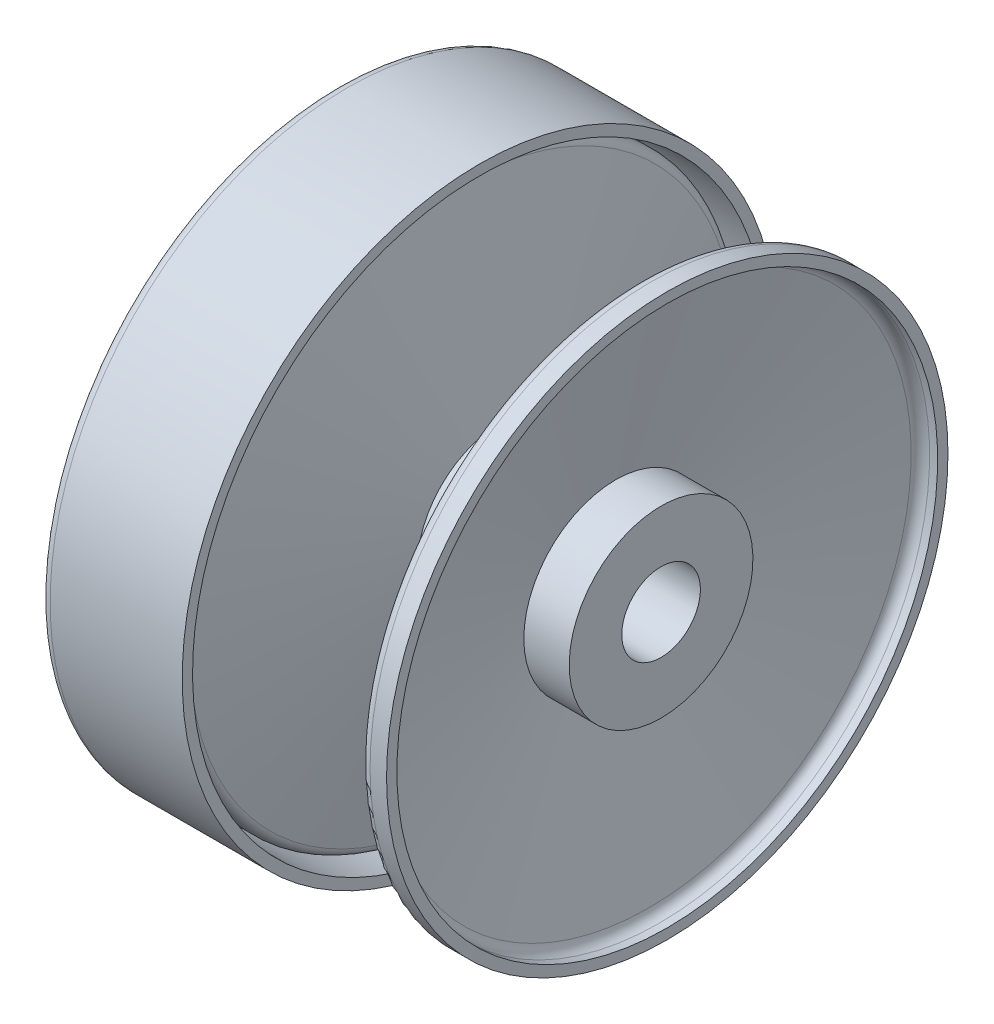
ISO-10303-21;
HEADER;
FILE_DESCRIPTION(('STEP AP214'),'2;1');
FILE_NAME('part.step','',(''),(''),'','','');
FILE_SCHEMA(('AUTOMOTIVE_DESIGN { 1 0 10303 214 1 1 1 1 }'));
ENDSEC;
DATA;
#1=APPLICATION_CONTEXT('core data for automotive mechanical design processes');
#2=APPLICATION_PROTOCOL_DEFINITION('international standard','automotive_design',2000,#1);
#3=PRODUCT_CONTEXT('',#1,'mechanical');
#4=PRODUCT('Part','Part','',(#3));
#5=PRODUCT_RELATED_PRODUCT_CATEGORY('part','',(#4));
#6=PRODUCT_DEFINITION_FORMATION('','',#4);
#7=PRODUCT_DEFINITION_CONTEXT('part definition',#1,'design');
#8=PRODUCT_DEFINITION('design','',#6,#7);
#9=PRODUCT_DEFINITION_SHAPE('','',#8);
#10=(LENGTH_UNIT() NAMED_UNIT(*) SI_UNIT(.MILLI.,.METRE.));
#11=(NAMED_UNIT(*) PLANE_ANGLE_UNIT() SI_UNIT($,.RADIAN.));
#12=(NAMED_UNIT(*) SI_UNIT($,.STERADIAN.) SOLID_ANGLE_UNIT());
#13=UNCERTAINTY_MEASURE_WITH_UNIT(LENGTH_MEASURE(1.E-05),#10,'distance_accuracy_value','');
#14=(GEOMETRIC_REPRESENTATION_CONTEXT(3) GLOBAL_UNCERTAINTY_ASSIGNED_CONTEXT((#13)) GLOBAL_UNIT_ASSIGNED_CONTEXT((#10,
#11,#12)) REPRESENTATION_CONTEXT('',''));
#15=CARTESIAN_POINT('',(0.,0.,0.));
#16=DIRECTION('',(0.,0.,1.));
#17=DIRECTION('',(1.,0.,0.));
#18=AXIS2_PLACEMENT_3D('',#15,#16,#17);
#19=CARTESIAN_POINT('',(-50.,12.75,0.));
#20=DIRECTION('',(1.,0.,0.));
#21=DIRECTION('',(0.,1.,0.));
#22=AXIS2_PLACEMENT_3D('',#19,#20,#21);
#23=PLANE('',#22);
#24=CARTESIAN_POINT('',(-50.,0.,0.));
#25=DIRECTION('',(-1.,0.,0.));
#26=DIRECTION('',(0.,-1.,0.));
#27=AXIS2_PLACEMENT_3D('',#24,#25,#26);
#28=CIRCLE('',#27,12.75);
#29=CARTESIAN_POINT('',(-50.,-12.75,0.));
#30=VERTEX_POINT('',#29);
#31=EDGE_CURVE('E168',#30,#30,#28,.T.);
#32=ORIENTED_EDGE('',*,*,#31,.F.);
#33=EDGE_LOOP('',(#32));
#34=FACE_BOUND('',#33,.T.);
#35=DIRECTION('',(0.,0.499999999999995,-0.866025403784442));
#36=VECTOR('',#35,1.);
#37=CARTESIAN_POINT('',(-50.,12.8750000000003,22.3001541474492));
#38=LINE('',#37,#36);
#39=CARTESIAN_POINT('',(-50.,12.8750000000003,22.3001541474492));
#40=VERTEX_POINT('',#39);
#41=CARTESIAN_POINT('',(-50.,25.75,0.));
#42=VERTEX_POINT('',#41);
#43=EDGE_CURVE('E100',#40,#42,#38,.T.);
#44=ORIENTED_EDGE('',*,*,#43,.T.);
#45=DIRECTION('',(0.,-0.500000000000001,-0.866025403784438));
#46=VECTOR('',#45,1.);
#47=CARTESIAN_POINT('',(-50.,25.75,0.));
#48=LINE('',#47,#46);
#49=CARTESIAN_POINT('',(-50.,12.875,-22.3001541474493));
#50=VERTEX_POINT('',#49);
#51=EDGE_CURVE('E108',#42,#50,#48,.T.);
#52=ORIENTED_EDGE('',*,*,#51,.T.);
#53=DIRECTION('',(0.,-1.,0.));
#54=VECTOR('',#53,1.);
#55=CARTESIAN_POINT('',(-50.,12.8749999999999,-22.3001541474493));
#56=LINE('',#55,#54);
#57=CARTESIAN_POINT('',(-50.,-12.8750000000001,-22.3001541474492));
#58=VERTEX_POINT('',#57);
#59=EDGE_CURVE('E59',#50,#58,#56,.T.);
#60=ORIENTED_EDGE('',*,*,#59,.T.);
#61=DIRECTION('',(0.,-0.499999999999995,0.866025403784441));
#62=VECTOR('',#61,1.);
#63=CARTESIAN_POINT('',(-50.,-12.8750000000001,-22.3001541474492));
#64=LINE('',#63,#62);
#65=CARTESIAN_POINT('',(-50.,-25.75,1.79811288950421E-13));
#66=VERTEX_POINT('',#65);
#67=EDGE_CURVE('E132',#58,#66,#64,.T.);
#68=ORIENTED_EDGE('',*,*,#67,.T.);
#69=DIRECTION('',(0.,0.500000000000007,0.866025403784434));
#70=VECTOR('',#69,1.);
#71=CARTESIAN_POINT('',(-50.,-25.75,1.79811288950421E-13));
#72=LINE('',#71,#70);
#73=CARTESIAN_POINT('',(-50.,-12.8749999999998,22.3001541474494));
#74=VERTEX_POINT('',#73);
#75=EDGE_CURVE('E129',#66,#74,#72,.T.);
#76=ORIENTED_EDGE('',*,*,#75,.T.);
#77=DIRECTION('',(0.,1.,0.));
#78=VECTOR('',#77,1.);
#79=CARTESIAN_POINT('',(-50.,-12.8749999999998,22.3001541474494));
#80=LINE('',#79,#78);
#81=EDGE_CURVE('E126',#74,#40,#80,.T.);
#82=ORIENTED_EDGE('',*,*,#81,.T.);
#83=EDGE_LOOP('',(#44,#52,#60,#68,#76,#82));
#84=FACE_BOUND('',#83,.T.);
#85=ADVANCED_FACE('F36',(#34,#84),#23,.F.);
#86=CARTESIAN_POINT('',(-50.,0.,0.));
#87=DIRECTION('',(-1.,0.,0.));
#88=DIRECTION('',(0.,-1.,0.));
#89=AXIS2_PLACEMENT_3D('',#86,#87,#88);
#90=CYLINDRICAL_SURFACE('',#89,68.);
#91=CARTESIAN_POINT('',(-2.05649403407394,0.,0.));
#92=DIRECTION('',(1.,0.,0.));
#93=DIRECTION('',(0.,1.,0.));
#94=AXIS2_PLACEMENT_3D('',#91,#92,#93);
#95=CIRCLE('',#94,68.);
#96=CARTESIAN_POINT('',(-2.05649403407395,68.,0.));
#97=VERTEX_POINT('',#96);
#98=EDGE_CURVE('E213',#97,#97,#95,.F.);
#99=ORIENTED_EDGE('',*,*,#98,.T.);
#100=EDGE_LOOP('',(#99));
#101=FACE_BOUND('',#100,.T.);
#102=CARTESIAN_POINT('',(-6.05649403407392,0.,0.));
#103=DIRECTION('',(-1.,0.,0.));
#104=DIRECTION('',(0.,-1.,0.));
#105=AXIS2_PLACEMENT_3D('',#102,#103,#104);
#106=CIRCLE('',#105,68.);
#107=CARTESIAN_POINT('',(-6.05649403407391,-68.,0.));
#108=VERTEX_POINT('',#107);
#109=EDGE_CURVE('E192',#108,#108,#106,.T.);
#110=ORIENTED_EDGE('',*,*,#109,.F.);
#111=EDGE_LOOP('',(#110));
#112=FACE_BOUND('',#111,.T.);
#113=ADVANCED_FACE('F242',(#101,#112),#90,.T.);
#114=CARTESIAN_POINT('',(-6.05649403407393,68.,0.));
#115=DIRECTION('',(1.,0.,0.));
#116=DIRECTION('',(0.,1.,0.));
#117=AXIS2_PLACEMENT_3D('',#114,#115,#116);
#118=PLANE('',#117);
#119=CARTESIAN_POINT('',(-6.05649403407392,0.,0.));
#120=DIRECTION('',(-1.,0.,0.));
#121=DIRECTION('',(0.,-1.,0.));
#122=AXIS2_PLACEMENT_3D('',#119,#120,#121);
#123=CIRCLE('',#122,65.5);
#124=CARTESIAN_POINT('',(-6.05649403407391,-65.5,0.));
#125=VERTEX_POINT('',#124);
#126=EDGE_CURVE('E189',#125,#125,#123,.T.);
#127=ORIENTED_EDGE('',*,*,#126,.F.);
#128=EDGE_LOOP('',(#127));
#129=FACE_BOUND('',#128,.T.);
#130=ORIENTED_EDGE('',*,*,#109,.T.);
#131=EDGE_LOOP('',(#130));
#132=FACE_BOUND('',#131,.T.);
#133=ADVANCED_FACE('F248',(#129,#132),#118,.F.);
#134=CARTESIAN_POINT('',(-50.,0.,0.));
#135=DIRECTION('',(-1.,0.,0.));
#136=DIRECTION('',(0.,-1.,0.));
#137=AXIS2_PLACEMENT_3D('',#134,#135,#136);
#138=CYLINDRICAL_SURFACE('',#137,65.5);
#139=CARTESIAN_POINT('',(-2.05649403407392,0.,0.));
#140=DIRECTION('',(-1.,0.,0.));
#141=DIRECTION('',(0.,-1.,0.));
#142=AXIS2_PLACEMENT_3D('',#139,#140,#141);
#143=CIRCLE('',#142,65.5);
#144=CARTESIAN_POINT('',(-2.05649403407391,-65.5,0.));
#145=VERTEX_POINT('',#144);
#146=EDGE_CURVE('E186',#145,#145,#143,.T.);
#147=ORIENTED_EDGE('',*,*,#146,.F.);
#148=EDGE_LOOP('',(#147));
#149=FACE_BOUND('',#148,.T.);
#150=ORIENTED_EDGE('',*,*,#126,.T.);
#151=EDGE_LOOP('',(#150));
#152=FACE_BOUND('',#151,.T.);
#153=ADVANCED_FACE('F291',(#149,#152),#138,.F.);
#154=CARTESIAN_POINT('',(-2.05649403407392,0.,0.));
#155=DIRECTION('',(-1.,0.,0.));
#156=DIRECTION('',(0.,-1.,0.));
#157=AXIS2_PLACEMENT_3D('',#154,#155,#156);
#158=CONICAL_SURFACE('',#157,65.5,1.37673779571502);
#159=CARTESIAN_POINT('',(6.44350596592599,0.,0.));
#160=DIRECTION('',(-1.,0.,0.));
#161=DIRECTION('',(0.,-1.,0.));
#162=AXIS2_PLACEMENT_3D('',#159,#160,#161);
#163=CIRCLE('',#162,22.25);
#164=CARTESIAN_POINT('',(6.44350596592599,-22.25,0.));
#165=VERTEX_POINT('',#164);
#166=EDGE_CURVE('E183',#165,#165,#163,.T.);
#167=ORIENTED_EDGE('',*,*,#166,.F.);
#168=EDGE_LOOP('',(#167));
#169=FACE_BOUND('',#168,.T.);
#170=ORIENTED_EDGE('',*,*,#146,.T.);
#171=EDGE_LOOP('',(#170));
#172=FACE_BOUND('',#171,.T.);
#173=ADVANCED_FACE('F287',(#169,#172),#158,.F.);
#174=CARTESIAN_POINT('',(-50.,0.,0.));
#175=DIRECTION('',(-1.,0.,0.));
#176=DIRECTION('',(0.,-1.,0.));
#177=AXIS2_PLACEMENT_3D('',#174,#175,#176);
#178=CYLINDRICAL_SURFACE('',#177,22.25);
#179=CARTESIAN_POINT('',(-15.,0.,0.));
#180=DIRECTION('',(-1.,0.,0.));
#181=DIRECTION('',(0.,-1.,0.));
#182=AXIS2_PLACEMENT_3D('',#179,#180,#181);
#183=CIRCLE('',#182,22.25);
#184=CARTESIAN_POINT('',(-15.,-22.25,0.));
#185=VERTEX_POINT('',#184);
#186=EDGE_CURVE('E180',#185,#185,#183,.T.);
#187=ORIENTED_EDGE('',*,*,#186,.F.);
#188=EDGE_LOOP('',(#187));
#189=FACE_BOUND('',#188,.T.);
#190=ORIENTED_EDGE('',*,*,#166,.T.);
#191=EDGE_LOOP('',(#190));
#192=FACE_BOUND('',#191,.T.);
#193=ADVANCED_FACE('F283',(#189,#192),#178,.T.);
#194=CARTESIAN_POINT('',(-15.,22.25,0.));
#195=DIRECTION('',(-1.,0.,0.));
#196=DIRECTION('',(0.,-1.,0.));
#197=AXIS2_PLACEMENT_3D('',#194,#195,#196);
#198=PLANE('',#197);
#199=CARTESIAN_POINT('',(-15.,0.,0.));
#200=DIRECTION('',(-1.,0.,0.));
#201=DIRECTION('',(0.,-1.,0.));
#202=AXIS2_PLACEMENT_3D('',#199,#200,#201);
#203=CIRCLE('',#202,69.5);
#204=CARTESIAN_POINT('',(-15.,-69.5,0.));
#205=VERTEX_POINT('',#204);
#206=EDGE_CURVE('E177',#205,#205,#203,.T.);
#207=ORIENTED_EDGE('',*,*,#206,.F.);
#208=EDGE_LOOP('',(#207));
#209=FACE_BOUND('',#208,.T.);
#210=ORIENTED_EDGE('',*,*,#186,.T.);
#211=EDGE_LOOP('',(#210));
#212=FACE_BOUND('',#211,.T.);
#213=ADVANCED_FACE('F279',(#209,#212),#198,.F.);
#214=CARTESIAN_POINT('',(-50.,0.,0.));
#215=DIRECTION('',(-1.,0.,0.));
#216=DIRECTION('',(0.,-1.,0.));
#217=AXIS2_PLACEMENT_3D('',#214,#215,#216);
#218=CYLINDRICAL_SURFACE('',#217,69.5);
#219=CARTESIAN_POINT('',(4.5,0.,0.));
#220=DIRECTION('',(-1.,0.,0.));
#221=DIRECTION('',(0.,-1.,0.));
#222=AXIS2_PLACEMENT_3D('',#219,#220,#221);
#223=CIRCLE('',#222,69.5);
#224=CARTESIAN_POINT('',(4.50000000000001,-69.5,0.));
#225=VERTEX_POINT('',#224);
#226=EDGE_CURVE('E174',#225,#225,#223,.T.);
#227=ORIENTED_EDGE('',*,*,#226,.F.);
#228=EDGE_LOOP('',(#227));
#229=FACE_BOUND('',#228,.T.);
#230=ORIENTED_EDGE('',*,*,#206,.T.);
#231=EDGE_LOOP('',(#230));
#232=FACE_BOUND('',#231,.T.);
#233=ADVANCED_FACE('F275',(#229,#232),#218,.F.);
#234=CARTESIAN_POINT('',(4.49999999999998,72.,0.));
#235=DIRECTION('',(-1.,0.,0.));
#236=DIRECTION('',(0.,-1.,0.));
#237=AXIS2_PLACEMENT_3D('',#234,#235,#236);
#238=PLANE('',#237);
#239=CARTESIAN_POINT('',(4.5,0.,0.));
#240=DIRECTION('',(-1.,0.,0.));
#241=DIRECTION('',(0.,-1.,0.));
#242=AXIS2_PLACEMENT_3D('',#239,#240,#241);
#243=CIRCLE('',#242,72.);
#244=CARTESIAN_POINT('',(4.50000000000001,-72.,0.));
#245=VERTEX_POINT('',#244);
#246=EDGE_CURVE('E171',#245,#245,#243,.T.);
#247=ORIENTED_EDGE('',*,*,#246,.F.);
#248=EDGE_LOOP('',(#247));
#249=FACE_BOUND('',#248,.T.);
#250=ORIENTED_EDGE('',*,*,#226,.T.);
#251=EDGE_LOOP('',(#250));
#252=FACE_BOUND('',#251,.T.);
#253=ADVANCED_FACE('F271',(#249,#252),#238,.F.);
#254=CARTESIAN_POINT('',(-50.,0.,0.));
#255=DIRECTION('',(-1.,0.,0.));
#256=DIRECTION('',(0.,-1.,0.));
#257=AXIS2_PLACEMENT_3D('',#254,#255,#256);
#258=CYLINDRICAL_SURFACE('',#257,72.);
#259=CARTESIAN_POINT('',(-27.5,0.,0.));
#260=DIRECTION('',(1.,0.,0.));
#261=DIRECTION('',(0.,1.,0.));
#262=AXIS2_PLACEMENT_3D('',#259,#260,#261);
#263=CIRCLE('',#262,72.);
#264=CARTESIAN_POINT('',(-27.5,72.,0.));
#265=VERTEX_POINT('',#264);
#266=EDGE_CURVE('E210',#265,#265,#263,.T.);
#267=ORIENTED_EDGE('',*,*,#266,.T.);
#268=EDGE_LOOP('',(#267));
#269=FACE_BOUND('',#268,.T.);
#270=ORIENTED_EDGE('',*,*,#246,.T.);
#271=EDGE_LOOP('',(#270));
#272=FACE_BOUND('',#271,.T.);
#273=ADVANCED_FACE('F267',(#269,#272),#258,.T.);
#274=CARTESIAN_POINT('',(-30.,52.,0.));
#275=DIRECTION('',(1.,0.,0.));
#276=DIRECTION('',(0.,1.,0.));
#277=AXIS2_PLACEMENT_3D('',#274,#275,#276);
#278=PLANE('',#277);
#279=CARTESIAN_POINT('',(-30.,0.,0.));
#280=DIRECTION('',(1.,0.,0.));
#281=DIRECTION('',(0.,1.,0.));
#282=AXIS2_PLACEMENT_3D('',#279,#280,#281);
#283=CIRCLE('',#282,53.5450849718747);
#284=CARTESIAN_POINT('',(-30.,53.5450849718747,0.));
#285=VERTEX_POINT('',#284);
#286=EDGE_CURVE('E207',#285,#285,#283,.T.);
#287=ORIENTED_EDGE('',*,*,#286,.T.);
#288=EDGE_LOOP('',(#287));
#289=FACE_BOUND('',#288,.T.);
#290=CARTESIAN_POINT('',(-30.,0.,0.));
#291=DIRECTION('',(1.,0.,0.));
#292=DIRECTION('',(0.,1.,0.));
#293=AXIS2_PLACEMENT_3D('',#290,#291,#292);
#294=CIRCLE('',#293,69.5);
#295=CARTESIAN_POINT('',(-30.,69.5,0.));
#296=VERTEX_POINT('',#295);
#297=EDGE_CURVE('E204',#296,#296,#294,.F.);
#298=ORIENTED_EDGE('',*,*,#297,.T.);
#299=EDGE_LOOP('',(#298));
#300=FACE_BOUND('',#299,.T.);
#301=ADVANCED_FACE('F263',(#289,#300),#278,.F.);
#302=CARTESIAN_POINT('',(-30.,0.,0.));
#303=DIRECTION('',(1.,0.,0.));
#304=DIRECTION('',(0.,1.,0.));
#305=AXIS2_PLACEMENT_3D('',#302,#303,#304);
#306=CONICAL_SURFACE('',#305,52.,0.463647609000805);
#307=CARTESIAN_POINT('',(-39.6180339887499,0.,0.));
#308=DIRECTION('',(-1.,0.,0.));
#309=DIRECTION('',(0.,-1.,0.));
#310=AXIS2_PLACEMENT_3D('',#307,#308,#309);
#311=CIRCLE('',#310,47.1909830056251);
#312=CARTESIAN_POINT('',(-39.6180339887499,-47.1909830056251,0.));
#313=VERTEX_POINT('',#312);
#314=EDGE_CURVE('E201',#313,#313,#311,.F.);
#315=ORIENTED_EDGE('',*,*,#314,.T.);
#316=EDGE_LOOP('',(#315));
#317=FACE_BOUND('',#316,.T.);
#318=CARTESIAN_POINT('',(-31.3819660112501,0.,0.));
#319=DIRECTION('',(1.,0.,0.));
#320=DIRECTION('',(0.,1.,0.));
#321=AXIS2_PLACEMENT_3D('',#318,#319,#320);
#322=CIRCLE('',#321,51.3090169943749);
#323=CARTESIAN_POINT('',(-31.3819660112501,51.3090169943749,0.));
#324=VERTEX_POINT('',#323);
#325=EDGE_CURVE('E198',#324,#324,#322,.F.);
#326=ORIENTED_EDGE('',*,*,#325,.T.);
#327=EDGE_LOOP('',(#326));
#328=FACE_BOUND('',#327,.T.);
#329=ADVANCED_FACE('F259',(#317,#328),#306,.T.);
#330=CARTESIAN_POINT('',(-41.,25.75,0.));
#331=DIRECTION('',(1.,0.,0.));
#332=DIRECTION('',(0.,1.,0.));
#333=AXIS2_PLACEMENT_3D('',#330,#331,#332);
#334=PLANE('',#333);
#335=CARTESIAN_POINT('',(-41.,0.,0.));
#336=DIRECTION('',(1.,0.,0.));
#337=DIRECTION('',(0.,1.,0.));
#338=AXIS2_PLACEMENT_3D('',#335,#336,#337);
#339=CIRCLE('',#338,44.9549150281253);
#340=CARTESIAN_POINT('',(-41.,44.9549150281253,0.));
#341=VERTEX_POINT('',#340);
#342=EDGE_CURVE('E195',#341,#341,#339,.F.);
#343=ORIENTED_EDGE('',*,*,#342,.T.);
#344=EDGE_LOOP('',(#343));
#345=FACE_BOUND('',#344,.T.);
#346=DIRECTION('',(0.,-0.500000000000001,-0.866025403784438));
#347=VECTOR('',#346,1.);
#348=CARTESIAN_POINT('',(-41.,25.75,0.));
#349=LINE('',#348,#347);
#350=CARTESIAN_POINT('',(-41.,25.75,0.));
#351=VERTEX_POINT('',#350);
#352=CARTESIAN_POINT('',(-41.,12.8749999999999,-22.3001541474493));
#353=VERTEX_POINT('',#352);
#354=EDGE_CURVE('E93',#351,#353,#349,.T.);
#355=ORIENTED_EDGE('',*,*,#354,.F.);
#356=DIRECTION('',(0.,0.499999999999995,-0.866025403784442));
#357=VECTOR('',#356,1.);
#358=CARTESIAN_POINT('',(-41.,12.8750000000003,22.3001541474492));
#359=LINE('',#358,#357);
#360=CARTESIAN_POINT('',(-41.,12.8750000000003,22.3001541474492));
#361=VERTEX_POINT('',#360);
#362=EDGE_CURVE('E51',#361,#351,#359,.T.);
#363=ORIENTED_EDGE('',*,*,#362,.F.);
#364=DIRECTION('',(0.,1.,0.));
#365=VECTOR('',#364,1.);
#366=CARTESIAN_POINT('',(-41.,-12.8749999999998,22.3001541474494));
#367=LINE('',#366,#365);
#368=CARTESIAN_POINT('',(-41.,-12.8749999999998,22.3001541474494));
#369=VERTEX_POINT('',#368);
#370=EDGE_CURVE('E89',#369,#361,#367,.T.);
#371=ORIENTED_EDGE('',*,*,#370,.F.);
#372=DIRECTION('',(0.,0.500000000000007,0.866025403784435));
#373=VECTOR('',#372,1.);
#374=CARTESIAN_POINT('',(-41.,-25.75,1.79809198572664E-13));
#375=LINE('',#374,#373);
#376=CARTESIAN_POINT('',(-41.,-25.75,1.79811288950421E-13));
#377=VERTEX_POINT('',#376);
#378=EDGE_CURVE('E115',#377,#369,#375,.T.);
#379=ORIENTED_EDGE('',*,*,#378,.F.);
#380=DIRECTION('',(0.,-0.499999999999995,0.866025403784442));
#381=VECTOR('',#380,1.);
#382=CARTESIAN_POINT('',(-41.,-12.8750000000001,-22.3001541474492));
#383=LINE('',#382,#381);
#384=CARTESIAN_POINT('',(-41.,-12.8750000000001,-22.3001541474492));
#385=VERTEX_POINT('',#384);
#386=EDGE_CURVE('E118',#385,#377,#383,.T.);
#387=ORIENTED_EDGE('',*,*,#386,.F.);
#388=DIRECTION('',(0.,-1.,0.));
#389=VECTOR('',#388,1.);
#390=CARTESIAN_POINT('',(-41.,12.8749999999999,-22.3001541474493));
#391=LINE('',#390,#389);
#392=EDGE_CURVE('E121',#353,#385,#391,.T.);
#393=ORIENTED_EDGE('',*,*,#392,.F.);
#394=EDGE_LOOP('',(#355,#363,#371,#379,#387,#393));
#395=FACE_BOUND('',#394,.T.);
#396=ADVANCED_FACE('F87',(#345,#395),#334,.F.);
#397=CARTESIAN_POINT('',(-50.,0.,0.));
#398=DIRECTION('',(-1.,0.,0.));
#399=DIRECTION('',(0.,-1.,0.));
#400=AXIS2_PLACEMENT_3D('',#397,#398,#399);
#401=CYLINDRICAL_SURFACE('',#400,12.75);
#402=CARTESIAN_POINT('',(-41.,0.,0.));
#403=DIRECTION('',(-1.,0.,0.));
#404=DIRECTION('',(0.,-1.,0.));
#405=AXIS2_PLACEMENT_3D('',#402,#403,#404);
#406=CIRCLE('',#405,12.75);
#407=CARTESIAN_POINT('',(-41.,-12.75,0.));
#408=VERTEX_POINT('',#407);
#409=EDGE_CURVE('E165',#408,#408,#406,.T.);
#410=ORIENTED_EDGE('',*,*,#409,.F.);
#411=EDGE_LOOP('',(#410));
#412=FACE_BOUND('',#411,.T.);
#413=ORIENTED_EDGE('',*,*,#31,.T.);
#414=EDGE_LOOP('',(#413));
#415=FACE_BOUND('',#414,.T.);
#416=ADVANCED_FACE('F255',(#412,#415),#401,.F.);
#417=CARTESIAN_POINT('',(-41.,4.25,0.));
#418=DIRECTION('',(1.,0.,0.));
#419=DIRECTION('',(0.,1.,0.));
#420=AXIS2_PLACEMENT_3D('',#417,#418,#419);
#421=PLANE('',#420);
#422=CARTESIAN_POINT('',(-41.,0.,0.));
#423=DIRECTION('',(-1.,0.,0.));
#424=DIRECTION('',(0.,-1.,0.));
#425=AXIS2_PLACEMENT_3D('',#422,#423,#424);
#426=CIRCLE('',#425,4.25);
#427=CARTESIAN_POINT('',(-41.,-4.25,0.));
#428=VERTEX_POINT('',#427);
#429=EDGE_CURVE('E162',#428,#428,#426,.T.);
#430=ORIENTED_EDGE('',*,*,#429,.F.);
#431=EDGE_LOOP('',(#430));
#432=FACE_BOUND('',#431,.T.);
#433=ORIENTED_EDGE('',*,*,#409,.T.);
#434=EDGE_LOOP('',(#433));
#435=FACE_BOUND('',#434,.T.);
#436=ADVANCED_FACE('F373',(#432,#435),#421,.F.);
#437=CARTESIAN_POINT('',(-50.,0.,0.));
#438=DIRECTION('',(-1.,0.,0.));
#439=DIRECTION('',(0.,-1.,0.));
#440=AXIS2_PLACEMENT_3D('',#437,#438,#439);
#441=CYLINDRICAL_SURFACE('',#440,4.25);
#442=CARTESIAN_POINT('',(-36.,0.,0.));
#443=DIRECTION('',(-1.,0.,0.));
#444=DIRECTION('',(0.,-1.,0.));
#445=AXIS2_PLACEMENT_3D('',#442,#443,#444);
#446=CIRCLE('',#445,4.25);
#447=CARTESIAN_POINT('',(-36.,-4.24999999999999,0.));
#448=VERTEX_POINT('',#447);
#449=EDGE_CURVE('E159',#448,#448,#446,.T.);
#450=ORIENTED_EDGE('',*,*,#449,.F.);
#451=EDGE_LOOP('',(#450));
#452=FACE_BOUND('',#451,.T.);
#453=ORIENTED_EDGE('',*,*,#429,.T.);
#454=EDGE_LOOP('',(#453));
#455=FACE_BOUND('',#454,.T.);
#456=ADVANCED_FACE('F370',(#452,#455),#441,.F.);
#457=CARTESIAN_POINT('',(-36.,4.25,0.));
#458=DIRECTION('',(-1.,0.,0.));
#459=DIRECTION('',(0.,-1.,0.));
#460=AXIS2_PLACEMENT_3D('',#457,#458,#459);
#461=PLANE('',#460);
#462=CARTESIAN_POINT('',(-36.,0.,0.));
#463=DIRECTION('',(-1.,0.,0.));
#464=DIRECTION('',(0.,-1.,0.));
#465=AXIS2_PLACEMENT_3D('',#462,#463,#464);
#466=CIRCLE('',#465,9.525);
#467=CARTESIAN_POINT('',(-36.,-9.525,0.));
#468=VERTEX_POINT('',#467);
#469=EDGE_CURVE('E156',#468,#468,#466,.T.);
#470=ORIENTED_EDGE('',*,*,#469,.F.);
#471=EDGE_LOOP('',(#470));
#472=FACE_BOUND('',#471,.T.);
#473=ORIENTED_EDGE('',*,*,#449,.T.);
#474=EDGE_LOOP('',(#473));
#475=FACE_BOUND('',#474,.T.);
#476=ADVANCED_FACE('F366',(#472,#475),#461,.F.);
#477=CARTESIAN_POINT('',(-50.,0.,0.));
#478=DIRECTION('',(-1.,0.,0.));
#479=DIRECTION('',(0.,-1.,0.));
#480=AXIS2_PLACEMENT_3D('',#477,#478,#479);
#481=CYLINDRICAL_SURFACE('',#480,9.52499999999999);
#482=CARTESIAN_POINT('',(48.5,0.,0.));
#483=DIRECTION('',(-1.,0.,0.));
#484=DIRECTION('',(0.,-1.,0.));
#485=AXIS2_PLACEMENT_3D('',#482,#483,#484);
#486=CIRCLE('',#485,9.52499999999998);
#487=CARTESIAN_POINT('',(48.5,-9.52499999999996,0.));
#488=VERTEX_POINT('',#487);
#489=EDGE_CURVE('E153',#488,#488,#486,.T.);
#490=ORIENTED_EDGE('',*,*,#489,.F.);
#491=EDGE_LOOP('',(#490));
#492=FACE_BOUND('',#491,.T.);
#493=ORIENTED_EDGE('',*,*,#469,.T.);
#494=EDGE_LOOP('',(#493));
#495=FACE_BOUND('',#494,.T.);
#496=ADVANCED_FACE('F362',(#492,#495),#481,.F.);
#497=CARTESIAN_POINT('',(48.5,9.525,0.));
#498=DIRECTION('',(-1.,0.,0.));
#499=DIRECTION('',(0.,-1.,0.));
#500=AXIS2_PLACEMENT_3D('',#497,#498,#499);
#501=PLANE('',#500);
#502=CARTESIAN_POINT('',(48.5,0.,0.));
#503=DIRECTION('',(-1.,0.,0.));
#504=DIRECTION('',(0.,-1.,0.));
#505=AXIS2_PLACEMENT_3D('',#502,#503,#504);
#506=CIRCLE('',#505,22.25);
#507=CARTESIAN_POINT('',(48.5,-22.25,0.));
#508=VERTEX_POINT('',#507);
#509=EDGE_CURVE('E150',#508,#508,#506,.T.);
#510=ORIENTED_EDGE('',*,*,#509,.F.);
#511=EDGE_LOOP('',(#510));
#512=FACE_BOUND('',#511,.T.);
#513=ORIENTED_EDGE('',*,*,#489,.T.);
#514=EDGE_LOOP('',(#513));
#515=FACE_BOUND('',#514,.T.);
#516=ADVANCED_FACE('F358',(#512,#515),#501,.F.);
#517=CARTESIAN_POINT('',(-50.,0.,0.));
#518=DIRECTION('',(-1.,0.,0.));
#519=DIRECTION('',(0.,-1.,0.));
#520=AXIS2_PLACEMENT_3D('',#517,#518,#519);
#521=CYLINDRICAL_SURFACE('',#520,22.25);
#522=CARTESIAN_POINT('',(37.5,0.,0.));
#523=DIRECTION('',(-1.,0.,0.));
#524=DIRECTION('',(0.,-1.,0.));
#525=AXIS2_PLACEMENT_3D('',#522,#523,#524);
#526=CIRCLE('',#525,22.25);
#527=CARTESIAN_POINT('',(37.5,-22.25,0.));
#528=VERTEX_POINT('',#527);
#529=EDGE_CURVE('E147',#528,#528,#526,.T.);
#530=ORIENTED_EDGE('',*,*,#529,.F.);
#531=EDGE_LOOP('',(#530));
#532=FACE_BOUND('',#531,.T.);
#533=ORIENTED_EDGE('',*,*,#509,.T.);
#534=EDGE_LOOP('',(#533));
#535=FACE_BOUND('',#534,.T.);
#536=ADVANCED_FACE('F354',(#532,#535),#521,.T.);
#537=CARTESIAN_POINT('',(37.5,0.,0.));
#538=DIRECTION('',(1.,0.,0.));
#539=DIRECTION('',(0.,1.,0.));
#540=AXIS2_PLACEMENT_3D('',#537,#538,#539);
#541=CONICAL_SURFACE('',#540,22.25,1.37673779571502);
#542=CARTESIAN_POINT('',(45.6034198842976,0.,0.));
#543=DIRECTION('',(1.,0.,0.));
#544=DIRECTION('',(0.,1.,0.));
#545=AXIS2_PLACEMENT_3D('',#542,#543,#544);
#546=CIRCLE('',#545,63.4821070583376);
#547=CARTESIAN_POINT('',(45.6034198842975,63.4821070583376,0.));
#548=VERTEX_POINT('',#547);
#549=EDGE_CURVE('E12',#548,#548,#546,.T.);
#550=ORIENTED_EDGE('',*,*,#549,.T.);
#551=EDGE_LOOP('',(#550));
#552=FACE_BOUND('',#551,.T.);
#553=ORIENTED_EDGE('',*,*,#529,.T.);
#554=EDGE_LOOP('',(#553));
#555=FACE_BOUND('',#554,.T.);
#556=ADVANCED_FACE('F351',(#552,#555),#541,.F.);
#557=CARTESIAN_POINT('',(-50.,0.,0.));
#558=DIRECTION('',(-1.,0.,0.));
#559=DIRECTION('',(0.,-1.,0.));
#560=AXIS2_PLACEMENT_3D('',#557,#558,#559);
#561=CYLINDRICAL_SURFACE('',#560,65.5);
#562=CARTESIAN_POINT('',(48.0564940340739,0.,0.));
#563=DIRECTION('',(-1.,0.,0.));
#564=DIRECTION('',(0.,-1.,0.));
#565=AXIS2_PLACEMENT_3D('',#562,#563,#564);
#566=CIRCLE('',#565,65.5);
#567=CARTESIAN_POINT('',(48.0564940340739,-65.5,0.));
#568=VERTEX_POINT('',#567);
#569=EDGE_CURVE('E44',#568,#568,#566,.T.);
#570=ORIENTED_EDGE('',*,*,#569,.T.);
#571=EDGE_LOOP('',(#570));
#572=FACE_BOUND('',#571,.T.);
#573=CARTESIAN_POINT('',(50.,0.,0.));
#574=DIRECTION('',(-1.,0.,0.));
#575=DIRECTION('',(0.,-1.,0.));
#576=AXIS2_PLACEMENT_3D('',#573,#574,#575);
#577=CIRCLE('',#576,65.5);
#578=CARTESIAN_POINT('',(50.,-65.5,0.));
#579=VERTEX_POINT('',#578);
#580=EDGE_CURVE('E144',#579,#579,#577,.T.);
#581=ORIENTED_EDGE('',*,*,#580,.F.);
#582=EDGE_LOOP('',(#581));
#583=FACE_BOUND('',#582,.T.);
#584=ADVANCED_FACE('F227',(#572,#583),#561,.F.);
#585=CARTESIAN_POINT('',(50.,65.5,0.));
#586=DIRECTION('',(-1.,0.,0.));
#587=DIRECTION('',(0.,-1.,0.));
#588=AXIS2_PLACEMENT_3D('',#585,#586,#587);
#589=PLANE('',#588);
#590=CARTESIAN_POINT('',(50.,0.,0.));
#591=DIRECTION('',(-1.,0.,0.));
#592=DIRECTION('',(0.,-1.,0.));
#593=AXIS2_PLACEMENT_3D('',#590,#591,#592);
#594=CIRCLE('',#593,68.);
#595=CARTESIAN_POINT('',(50.,-68.,0.));
#596=VERTEX_POINT('',#595);
#597=EDGE_CURVE('E141',#596,#596,#594,.T.);
#598=ORIENTED_EDGE('',*,*,#597,.F.);
#599=EDGE_LOOP('',(#598));
#600=FACE_BOUND('',#599,.T.);
#601=ORIENTED_EDGE('',*,*,#580,.T.);
#602=EDGE_LOOP('',(#601));
#603=FACE_BOUND('',#602,.T.);
#604=ADVANCED_FACE('F342',(#600,#603),#589,.F.);
#605=CARTESIAN_POINT('',(-50.,0.,0.));
#606=DIRECTION('',(-1.,0.,0.));
#607=DIRECTION('',(0.,-1.,0.));
#608=AXIS2_PLACEMENT_3D('',#605,#606,#607);
#609=CYLINDRICAL_SURFACE('',#608,68.);
#610=CARTESIAN_POINT('',(46.,0.,0.));
#611=DIRECTION('',(1.,0.,0.));
#612=DIRECTION('',(0.,1.,0.));
#613=AXIS2_PLACEMENT_3D('',#610,#611,#612);
#614=CIRCLE('',#613,68.);
#615=CARTESIAN_POINT('',(46.,68.,0.));
#616=VERTEX_POINT('',#615);
#617=EDGE_CURVE('E222',#616,#616,#614,.T.);
#618=ORIENTED_EDGE('',*,*,#617,.T.);
#619=EDGE_LOOP('',(#618));
#620=FACE_BOUND('',#619,.T.);
#621=ORIENTED_EDGE('',*,*,#597,.T.);
#622=EDGE_LOOP('',(#621));
#623=FACE_BOUND('',#622,.T.);
#624=ADVANCED_FACE('F336',(#620,#623),#609,.T.);
#625=CARTESIAN_POINT('',(43.9435059659261,0.,0.));
#626=DIRECTION('',(1.,0.,0.));
#627=DIRECTION('',(0.,1.,0.));
#628=AXIS2_PLACEMENT_3D('',#625,#626,#627);
#629=CONICAL_SURFACE('',#628,68.,1.37673779571502);
#630=CARTESIAN_POINT('',(43.5469258502236,0.,0.));
#631=DIRECTION('',(-1.,0.,0.));
#632=DIRECTION('',(0.,-1.,0.));
#633=AXIS2_PLACEMENT_3D('',#630,#631,#632);
#634=CIRCLE('',#633,65.9821070583375);
#635=CARTESIAN_POINT('',(43.5469258502237,-65.9821070583375,0.));
#636=VERTEX_POINT('',#635);
#637=EDGE_CURVE('E219',#636,#636,#634,.T.);
#638=ORIENTED_EDGE('',*,*,#637,.T.);
#639=EDGE_LOOP('',(#638));
#640=FACE_BOUND('',#639,.T.);
#641=CARTESIAN_POINT('',(34.5099799543654,0.,0.));
#642=DIRECTION('',(-1.,0.,0.));
#643=DIRECTION('',(0.,-1.,0.));
#644=AXIS2_PLACEMENT_3D('',#641,#642,#643);
#645=CIRCLE('',#644,20.);
#646=CARTESIAN_POINT('',(34.5099799543654,-20.,0.));
#647=VERTEX_POINT('',#646);
#648=EDGE_CURVE('E138',#647,#647,#645,.T.);
#649=ORIENTED_EDGE('',*,*,#648,.F.);
#650=EDGE_LOOP('',(#649));
#651=FACE_BOUND('',#650,.T.);
#652=ADVANCED_FACE('F331',(#640,#651),#629,.T.);
#653=CARTESIAN_POINT('',(-50.,0.,0.));
#654=DIRECTION('',(-1.,0.,0.));
#655=DIRECTION('',(0.,-1.,0.));
#656=AXIS2_PLACEMENT_3D('',#653,#654,#655);
#657=CYLINDRICAL_SURFACE('',#656,20.);
#658=CARTESIAN_POINT('',(9.4335260115606,0.,0.));
#659=DIRECTION('',(-1.,0.,0.));
#660=DIRECTION('',(0.,-1.,0.));
#661=AXIS2_PLACEMENT_3D('',#658,#659,#660);
#662=CIRCLE('',#661,20.);
#663=CARTESIAN_POINT('',(9.43352601156061,-20.,0.));
#664=VERTEX_POINT('',#663);
#665=EDGE_CURVE('E117',#664,#664,#662,.T.);
#666=ORIENTED_EDGE('',*,*,#665,.F.);
#667=EDGE_LOOP('',(#666));
#668=FACE_BOUND('',#667,.T.);
#669=ORIENTED_EDGE('',*,*,#648,.T.);
#670=EDGE_LOOP('',(#669));
#671=FACE_BOUND('',#670,.T.);
#672=ADVANCED_FACE('F325',(#668,#671),#657,.T.);
#673=CARTESIAN_POINT('',(9.4335260115606,0.,0.));
#674=DIRECTION('',(-1.,0.,0.));
#675=DIRECTION('',(0.,-1.,0.));
#676=AXIS2_PLACEMENT_3D('',#673,#674,#675);
#677=CONICAL_SURFACE('',#676,20.,1.37673779571502);
#678=CARTESIAN_POINT('',(0.396580115702448,0.,0.));
#679=DIRECTION('',(1.,0.,0.));
#680=DIRECTION('',(0.,1.,0.));
#681=AXIS2_PLACEMENT_3D('',#678,#679,#680);
#682=CIRCLE('',#681,65.9821070583376);
#683=CARTESIAN_POINT('',(0.396580115702436,65.9821070583376,0.));
#684=VERTEX_POINT('',#683);
#685=EDGE_CURVE('E216',#684,#684,#682,.T.);
#686=ORIENTED_EDGE('',*,*,#685,.T.);
#687=EDGE_LOOP('',(#686));
#688=FACE_BOUND('',#687,.T.);
#689=ORIENTED_EDGE('',*,*,#665,.T.);
#690=EDGE_LOOP('',(#689));
#691=FACE_BOUND('',#690,.T.);
#692=ADVANCED_FACE('F303',(#688,#691),#677,.T.);
#693=CARTESIAN_POINT('',(-38.5,0.,0.));
#694=DIRECTION('',(1.,0.,0.));
#695=DIRECTION('',(0.,1.,0.));
#696=AXIS2_PLACEMENT_3D('',#693,#694,#695);
#697=TOROIDAL_SURFACE('',#696,44.9549150281253,2.5);
#698=ORIENTED_EDGE('',*,*,#314,.F.);
#699=EDGE_LOOP('',(#698));
#700=FACE_BOUND('',#699,.T.);
#701=ORIENTED_EDGE('',*,*,#342,.F.);
#702=EDGE_LOOP('',(#701));
#703=FACE_BOUND('',#702,.T.);
#704=ADVANCED_FACE('F299',(#700,#703),#697,.T.);
#705=CARTESIAN_POINT('',(-32.5,0.,0.));
#706=DIRECTION('',(1.,0.,0.));
#707=DIRECTION('',(0.,1.,0.));
#708=AXIS2_PLACEMENT_3D('',#705,#706,#707);
#709=TOROIDAL_SURFACE('',#708,53.5450849718747,2.5);
#710=ORIENTED_EDGE('',*,*,#286,.F.);
#711=EDGE_LOOP('',(#710));
#712=FACE_BOUND('',#711,.T.);
#713=ORIENTED_EDGE('',*,*,#325,.F.);
#714=EDGE_LOOP('',(#713));
#715=FACE_BOUND('',#714,.T.);
#716=ADVANCED_FACE('F302',(#712,#715),#709,.F.);
#717=CARTESIAN_POINT('',(-27.5,0.,0.));
#718=DIRECTION('',(1.,0.,0.));
#719=DIRECTION('',(0.,1.,0.));
#720=AXIS2_PLACEMENT_3D('',#717,#718,#719);
#721=TOROIDAL_SURFACE('',#720,69.5,2.5);
#722=ORIENTED_EDGE('',*,*,#266,.F.);
#723=EDGE_LOOP('',(#722));
#724=FACE_BOUND('',#723,.T.);
#725=ORIENTED_EDGE('',*,*,#297,.F.);
#726=EDGE_LOOP('',(#725));
#727=FACE_BOUND('',#726,.T.);
#728=ADVANCED_FACE('F307',(#724,#727),#721,.T.);
#729=CARTESIAN_POINT('',(-2.05649403407393,0.,0.));
#730=DIRECTION('',(1.,0.,0.));
#731=DIRECTION('',(0.,1.,0.));
#732=AXIS2_PLACEMENT_3D('',#729,#730,#731);
#733=TOROIDAL_SURFACE('',#732,65.5,2.5);
#734=ORIENTED_EDGE('',*,*,#685,.F.);
#735=EDGE_LOOP('',(#734));
#736=FACE_BOUND('',#735,.T.);
#737=ORIENTED_EDGE('',*,*,#98,.F.);
#738=EDGE_LOOP('',(#737));
#739=FACE_BOUND('',#738,.T.);
#740=ADVANCED_FACE('F238',(#736,#739),#733,.T.);
#741=CARTESIAN_POINT('',(46.,0.,0.));
#742=DIRECTION('',(1.,0.,0.));
#743=DIRECTION('',(0.,1.,0.));
#744=AXIS2_PLACEMENT_3D('',#741,#742,#743);
#745=TOROIDAL_SURFACE('',#744,65.5,2.5);
#746=ORIENTED_EDGE('',*,*,#617,.F.);
#747=EDGE_LOOP('',(#746));
#748=FACE_BOUND('',#747,.T.);
#749=ORIENTED_EDGE('',*,*,#637,.F.);
#750=EDGE_LOOP('',(#749));
#751=FACE_BOUND('',#750,.T.);
#752=ADVANCED_FACE('F231',(#748,#751),#745,.T.);
#753=CARTESIAN_POINT('',(48.0564940340739,0.,0.));
#754=DIRECTION('',(-1.,0.,0.));
#755=DIRECTION('',(0.,-1.,0.));
#756=AXIS2_PLACEMENT_3D('',#753,#754,#755);
#757=TOROIDAL_SURFACE('',#756,63.,2.5);
#758=ORIENTED_EDGE('',*,*,#549,.F.);
#759=EDGE_LOOP('',(#758));
#760=FACE_BOUND('',#759,.T.);
#761=ORIENTED_EDGE('',*,*,#569,.F.);
#762=EDGE_LOOP('',(#761));
#763=FACE_BOUND('',#762,.T.);
#764=ADVANCED_FACE('F38',(#760,#763),#757,.F.);
#765=CARTESIAN_POINT('',(164.683220511543,12.8750000000003,22.3001541474492));
#766=DIRECTION('',(0.,0.866025403784442,0.499999999999995));
#767=DIRECTION('',(0.,-0.499999999999995,0.866025403784442));
#768=AXIS2_PLACEMENT_3D('',#765,#766,#767);
#769=PLANE('',#768);
#770=ORIENTED_EDGE('',*,*,#362,.T.);
#771=DIRECTION('',(-1.,0.,0.));
#772=VECTOR('',#771,1.);
#773=CARTESIAN_POINT('',(164.683220511543,25.75,0.));
#774=LINE('',#773,#772);
#775=EDGE_CURVE('E111',#351,#42,#774,.T.);
#776=ORIENTED_EDGE('',*,*,#775,.T.);
#777=ORIENTED_EDGE('',*,*,#43,.F.);
#778=DIRECTION('',(-1.,0.,0.));
#779=VECTOR('',#778,1.);
#780=CARTESIAN_POINT('',(164.683220511543,12.8750000000003,22.3001541474492));
#781=LINE('',#780,#779);
#782=EDGE_CURVE('E97',#361,#40,#781,.T.);
#783=ORIENTED_EDGE('',*,*,#782,.F.);
#784=EDGE_LOOP('',(#770,#776,#777,#783));
#785=FACE_BOUND('',#784,.T.);
#786=ADVANCED_FACE('F98',(#785),#769,.T.);
#787=CARTESIAN_POINT('',(164.683220511543,-12.8749999999998,22.3001541474494));
#788=DIRECTION('',(0.,0.,1.));
#789=DIRECTION('',(0.,-1.,0.));
#790=AXIS2_PLACEMENT_3D('',#787,#788,#789);
#791=PLANE('',#790);
#792=ORIENTED_EDGE('',*,*,#370,.T.);
#793=ORIENTED_EDGE('',*,*,#782,.T.);
#794=ORIENTED_EDGE('',*,*,#81,.F.);
#795=DIRECTION('',(-1.,0.,0.));
#796=VECTOR('',#795,1.);
#797=CARTESIAN_POINT('',(164.683220511543,-12.8749999999998,22.3001541474494));
#798=LINE('',#797,#796);
#799=EDGE_CURVE('E106',#369,#74,#798,.T.);
#800=ORIENTED_EDGE('',*,*,#799,.F.);
#801=EDGE_LOOP('',(#792,#793,#794,#800));
#802=FACE_BOUND('',#801,.T.);
#803=ADVANCED_FACE('F105',(#802),#791,.T.);
#804=CARTESIAN_POINT('',(164.683220511543,-25.75,1.79811288950421E-13));
#805=DIRECTION('',(0.,-0.866025403784435,0.500000000000007));
#806=DIRECTION('',(0.,-0.500000000000007,-0.866025403784435));
#807=AXIS2_PLACEMENT_3D('',#804,#805,#806);
#808=PLANE('',#807);
#809=ORIENTED_EDGE('',*,*,#378,.T.);
#810=ORIENTED_EDGE('',*,*,#799,.T.);
#811=ORIENTED_EDGE('',*,*,#75,.F.);
#812=DIRECTION('',(-1.,0.,0.));
#813=VECTOR('',#812,1.);
#814=CARTESIAN_POINT('',(164.683220511543,-25.75,1.79811288950421E-13));
#815=LINE('',#814,#813);
#816=EDGE_CURVE('E127',#377,#66,#815,.T.);
#817=ORIENTED_EDGE('',*,*,#816,.F.);
#818=EDGE_LOOP('',(#809,#810,#811,#817));
#819=FACE_BOUND('',#818,.T.);
#820=ADVANCED_FACE('F534',(#819),#808,.T.);
#821=CARTESIAN_POINT('',(164.683220511543,-12.8750000000001,-22.3001541474492));
#822=DIRECTION('',(0.,-0.866025403784441,-0.499999999999995));
#823=DIRECTION('',(0.,0.499999999999995,-0.866025403784442));
#824=AXIS2_PLACEMENT_3D('',#821,#822,#823);
#825=PLANE('',#824);
#826=ORIENTED_EDGE('',*,*,#386,.T.);
#827=ORIENTED_EDGE('',*,*,#816,.T.);
#828=ORIENTED_EDGE('',*,*,#67,.F.);
#829=DIRECTION('',(-1.,0.,0.));
#830=VECTOR('',#829,1.);
#831=CARTESIAN_POINT('',(164.683220511543,-12.8750000000001,-22.3001541474492));
#832=LINE('',#831,#830);
#833=EDGE_CURVE('E130',#385,#58,#832,.T.);
#834=ORIENTED_EDGE('',*,*,#833,.F.);
#835=EDGE_LOOP('',(#826,#827,#828,#834));
#836=FACE_BOUND('',#835,.T.);
#837=ADVANCED_FACE('F542',(#836),#825,.T.);
#838=CARTESIAN_POINT('',(164.683220511543,12.875,-22.3001541474493));
#839=DIRECTION('',(0.,0.,-1.));
#840=DIRECTION('',(0.,1.,0.));
#841=AXIS2_PLACEMENT_3D('',#838,#839,#840);
#842=PLANE('',#841);
#843=ORIENTED_EDGE('',*,*,#392,.T.);
#844=ORIENTED_EDGE('',*,*,#833,.T.);
#845=ORIENTED_EDGE('',*,*,#59,.F.);
#846=DIRECTION('',(-1.,0.,0.));
#847=VECTOR('',#846,1.);
#848=CARTESIAN_POINT('',(164.683220511543,12.875,-22.3001541474493));
#849=LINE('',#848,#847);
#850=EDGE_CURVE('E133',#353,#50,#849,.T.);
#851=ORIENTED_EDGE('',*,*,#850,.F.);
#852=EDGE_LOOP('',(#843,#844,#845,#851));
#853=FACE_BOUND('',#852,.T.);
#854=ADVANCED_FACE('F551',(#853),#842,.T.);
#855=CARTESIAN_POINT('',(164.683220511543,25.75,0.));
#856=DIRECTION('',(0.,0.866025403784438,-0.500000000000001));
#857=DIRECTION('',(0.,0.500000000000001,0.866025403784438));
#858=AXIS2_PLACEMENT_3D('',#855,#856,#857);
#859=PLANE('',#858);
#860=ORIENTED_EDGE('',*,*,#354,.T.);
#861=ORIENTED_EDGE('',*,*,#850,.T.);
#862=ORIENTED_EDGE('',*,*,#51,.F.);
#863=ORIENTED_EDGE('',*,*,#775,.F.);
#864=EDGE_LOOP('',(#860,#861,#862,#863));
#865=FACE_BOUND('',#864,.T.);
#866=ADVANCED_FACE('F560',(#865),#859,.T.);
#867=CLOSED_SHELL('',(#85,#113,#133,#153,#173,#193,#213,#233,#253,#273,#301,#329,#396,#416,#436,
#456,#476,#496,#516,#536,#556,#584,#604,#624,#652,#672,#692,#704,#716,#728,#740,#752,#764,#786,
#803,#820,#837,#854,#866));
#868=MANIFOLD_SOLID_BREP('B2',#867);
#869=ADVANCED_BREP_SHAPE_REPRESENTATION('',(#18,#868),#14);
#870=SHAPE_DEFINITION_REPRESENTATION(#9,#869);
ENDSEC;
END-ISO-10303-21;
